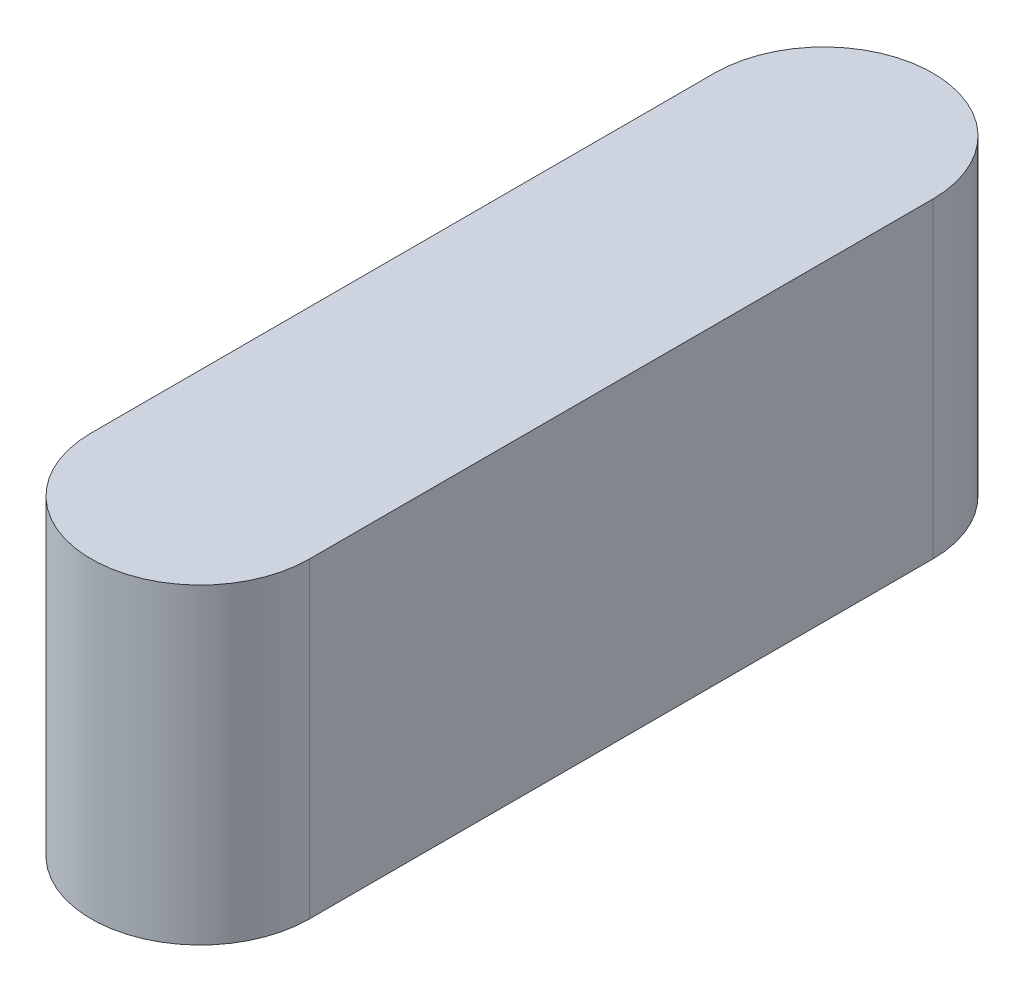
ISO-10303-21;
HEADER;
FILE_DESCRIPTION(('STEP AP214'),'2;1');
FILE_NAME('part.step','',(''),(''),'','','');
FILE_SCHEMA(('AUTOMOTIVE_DESIGN { 1 0 10303 214 1 1 1 1 }'));
ENDSEC;
DATA;
#1=APPLICATION_CONTEXT('core data for automotive mechanical design processes');
#2=APPLICATION_PROTOCOL_DEFINITION('international standard','automotive_design',2000,#1);
#3=PRODUCT_CONTEXT('',#1,'mechanical');
#4=PRODUCT('Part','Part','',(#3));
#5=PRODUCT_RELATED_PRODUCT_CATEGORY('part','',(#4));
#6=PRODUCT_DEFINITION_FORMATION('','',#4);
#7=PRODUCT_DEFINITION_CONTEXT('part definition',#1,'design');
#8=PRODUCT_DEFINITION('design','',#6,#7);
#9=PRODUCT_DEFINITION_SHAPE('','',#8);
#10=(LENGTH_UNIT() NAMED_UNIT(*) SI_UNIT(.MILLI.,.METRE.));
#11=(NAMED_UNIT(*) PLANE_ANGLE_UNIT() SI_UNIT($,.RADIAN.));
#12=(NAMED_UNIT(*) SI_UNIT($,.STERADIAN.) SOLID_ANGLE_UNIT());
#13=UNCERTAINTY_MEASURE_WITH_UNIT(LENGTH_MEASURE(1.E-05),#10,'distance_accuracy_value','');
#14=(GEOMETRIC_REPRESENTATION_CONTEXT(3) GLOBAL_UNCERTAINTY_ASSIGNED_CONTEXT((#13)) GLOBAL_UNIT_ASSIGNED_CONTEXT((#10,
#11,#12)) REPRESENTATION_CONTEXT('',''));
#15=CARTESIAN_POINT('',(0.,0.,0.));
#16=DIRECTION('',(0.,0.,1.));
#17=DIRECTION('',(1.,0.,0.));
#18=AXIS2_PLACEMENT_3D('',#15,#16,#17);
#19=CARTESIAN_POINT('',(0.,5.,8.71399407121683));
#20=DIRECTION('',(0.,-1.,0.));
#21=DIRECTION('',(0.,0.,-1.));
#22=AXIS2_PLACEMENT_3D('',#19,#20,#21);
#23=CYLINDRICAL_SURFACE('',#22,1.75);
#24=CARTESIAN_POINT('',(0.,0.,8.71399407121683));
#25=DIRECTION('',(0.,1.,0.));
#26=DIRECTION('',(0.,0.,1.));
#27=AXIS2_PLACEMENT_3D('',#24,#25,#26);
#28=CIRCLE('',#27,1.75);
#29=CARTESIAN_POINT('',(1.75,0.,8.71399407121684));
#30=VERTEX_POINT('',#29);
#31=CARTESIAN_POINT('',(-1.75,0.,8.71399407121683));
#32=VERTEX_POINT('',#31);
#33=EDGE_CURVE('E98',#30,#32,#28,.T.);
#34=ORIENTED_EDGE('',*,*,#33,.T.);
#35=DIRECTION('',(0.,-1.,0.));
#36=VECTOR('',#35,1.);
#37=CARTESIAN_POINT('',(-1.75,5.,8.71399407121683));
#38=LINE('',#37,#36);
#39=CARTESIAN_POINT('',(-1.75,5.,8.71399407121683));
#40=VERTEX_POINT('',#39);
#41=EDGE_CURVE('E11',#40,#32,#38,.T.);
#42=ORIENTED_EDGE('',*,*,#41,.F.);
#43=CARTESIAN_POINT('',(0.,5.,8.71399407121683));
#44=DIRECTION('',(0.,1.,0.));
#45=DIRECTION('',(0.,0.,1.));
#46=AXIS2_PLACEMENT_3D('',#43,#44,#45);
#47=CIRCLE('',#46,1.75);
#48=CARTESIAN_POINT('',(1.75,5.,8.71399407121684));
#49=VERTEX_POINT('',#48);
#50=EDGE_CURVE('E86',#49,#40,#47,.T.);
#51=ORIENTED_EDGE('',*,*,#50,.F.);
#52=DIRECTION('',(0.,-1.,0.));
#53=VECTOR('',#52,1.);
#54=CARTESIAN_POINT('',(1.75,5.,8.71399407121684));
#55=LINE('',#54,#53);
#56=EDGE_CURVE('E94',#49,#30,#55,.T.);
#57=ORIENTED_EDGE('',*,*,#56,.T.);
#58=EDGE_LOOP('',(#34,#42,#51,#57));
#59=FACE_BOUND('',#58,.T.);
#60=ADVANCED_FACE('F35',(#59),#23,.T.);
#61=CARTESIAN_POINT('',(-1.75,5.,8.71399407121683));
#62=DIRECTION('',(1.,0.,0.));
#63=DIRECTION('',(0.,0.,-1.));
#64=AXIS2_PLACEMENT_3D('',#61,#62,#63);
#65=PLANE('',#64);
#66=DIRECTION('',(0.,0.,1.));
#67=VECTOR('',#66,1.);
#68=CARTESIAN_POINT('',(-1.75,0.,8.71399407121683));
#69=LINE('',#68,#67);
#70=CARTESIAN_POINT('',(-1.75000000000001,0.,18.7139940712168));
#71=VERTEX_POINT('',#70);
#72=EDGE_CURVE('E90',#32,#71,#69,.T.);
#73=ORIENTED_EDGE('',*,*,#72,.T.);
#74=DIRECTION('',(0.,-1.,0.));
#75=VECTOR('',#74,1.);
#76=CARTESIAN_POINT('',(-1.75000000000001,5.,18.7139940712168));
#77=LINE('',#76,#75);
#78=CARTESIAN_POINT('',(-1.75000000000001,5.,18.7139940712168));
#79=VERTEX_POINT('',#78);
#80=EDGE_CURVE('E43',#79,#71,#77,.T.);
#81=ORIENTED_EDGE('',*,*,#80,.F.);
#82=DIRECTION('',(0.,0.,1.));
#83=VECTOR('',#82,1.);
#84=CARTESIAN_POINT('',(-1.75,5.,8.71399407121683));
#85=LINE('',#84,#83);
#86=EDGE_CURVE('E81',#40,#79,#85,.T.);
#87=ORIENTED_EDGE('',*,*,#86,.F.);
#88=ORIENTED_EDGE('',*,*,#41,.T.);
#89=EDGE_LOOP('',(#73,#81,#87,#88));
#90=FACE_BOUND('',#89,.T.);
#91=ADVANCED_FACE('F89',(#90),#65,.F.);
#92=CARTESIAN_POINT('',(0.,5.,18.7139940712168));
#93=DIRECTION('',(0.,-1.,0.));
#94=DIRECTION('',(0.,0.,-1.));
#95=AXIS2_PLACEMENT_3D('',#92,#93,#94);
#96=CYLINDRICAL_SURFACE('',#95,1.75000000000001);
#97=CARTESIAN_POINT('',(0.,0.,18.7139940712168));
#98=DIRECTION('',(0.,1.,0.));
#99=DIRECTION('',(0.,0.,1.));
#100=AXIS2_PLACEMENT_3D('',#97,#98,#99);
#101=CIRCLE('',#100,1.75000000000001);
#102=CARTESIAN_POINT('',(1.75000000000001,0.,18.7139940712168));
#103=VERTEX_POINT('',#102);
#104=EDGE_CURVE('E68',#71,#103,#101,.T.);
#105=ORIENTED_EDGE('',*,*,#104,.T.);
#106=DIRECTION('',(0.,-1.,0.));
#107=VECTOR('',#106,1.);
#108=CARTESIAN_POINT('',(1.75000000000001,5.,18.7139940712168));
#109=LINE('',#108,#107);
#110=CARTESIAN_POINT('',(1.75000000000001,5.,18.7139940712168));
#111=VERTEX_POINT('',#110);
#112=EDGE_CURVE('E91',#111,#103,#109,.T.);
#113=ORIENTED_EDGE('',*,*,#112,.F.);
#114=CARTESIAN_POINT('',(0.,5.,18.7139940712168));
#115=DIRECTION('',(0.,1.,0.));
#116=DIRECTION('',(0.,0.,1.));
#117=AXIS2_PLACEMENT_3D('',#114,#115,#116);
#118=CIRCLE('',#117,1.75000000000001);
#119=EDGE_CURVE('E84',#79,#111,#118,.T.);
#120=ORIENTED_EDGE('',*,*,#119,.F.);
#121=ORIENTED_EDGE('',*,*,#80,.T.);
#122=EDGE_LOOP('',(#105,#113,#120,#121));
#123=FACE_BOUND('',#122,.T.);
#124=ADVANCED_FACE('F92',(#123),#96,.T.);
#125=CARTESIAN_POINT('',(1.75,5.,8.71399407121684));
#126=DIRECTION('',(-1.,0.,0.));
#127=DIRECTION('',(0.,0.,1.));
#128=AXIS2_PLACEMENT_3D('',#125,#126,#127);
#129=PLANE('',#128);
#130=DIRECTION('',(0.,0.,-1.));
#131=VECTOR('',#130,1.);
#132=CARTESIAN_POINT('',(1.75,0.,8.71399407121684));
#133=LINE('',#132,#131);
#134=EDGE_CURVE('E74',#103,#30,#133,.T.);
#135=ORIENTED_EDGE('',*,*,#134,.T.);
#136=ORIENTED_EDGE('',*,*,#56,.F.);
#137=DIRECTION('',(0.,0.,-1.));
#138=VECTOR('',#137,1.);
#139=CARTESIAN_POINT('',(1.75,5.,8.71399407121684));
#140=LINE('',#139,#138);
#141=EDGE_CURVE('E51',#111,#49,#140,.T.);
#142=ORIENTED_EDGE('',*,*,#141,.F.);
#143=ORIENTED_EDGE('',*,*,#112,.T.);
#144=EDGE_LOOP('',(#135,#136,#142,#143));
#145=FACE_BOUND('',#144,.T.);
#146=ADVANCED_FACE('F105',(#145),#129,.F.);
#147=CARTESIAN_POINT('',(0.,5.,8.71399407121683));
#148=DIRECTION('',(0.,1.,0.));
#149=DIRECTION('',(0.,0.,1.));
#150=AXIS2_PLACEMENT_3D('',#147,#148,#149);
#151=PLANE('',#150);
#152=ORIENTED_EDGE('',*,*,#50,.T.);
#153=ORIENTED_EDGE('',*,*,#86,.T.);
#154=ORIENTED_EDGE('',*,*,#119,.T.);
#155=ORIENTED_EDGE('',*,*,#141,.T.);
#156=EDGE_LOOP('',(#152,#153,#154,#155));
#157=FACE_BOUND('',#156,.T.);
#158=ADVANCED_FACE('F82',(#157),#151,.T.);
#159=CARTESIAN_POINT('',(0.,0.,8.71399407121683));
#160=DIRECTION('',(0.,1.,0.));
#161=DIRECTION('',(0.,0.,1.));
#162=AXIS2_PLACEMENT_3D('',#159,#160,#161);
#163=PLANE('',#162);
#164=ORIENTED_EDGE('',*,*,#33,.F.);
#165=ORIENTED_EDGE('',*,*,#134,.F.);
#166=ORIENTED_EDGE('',*,*,#104,.F.);
#167=ORIENTED_EDGE('',*,*,#72,.F.);
#168=EDGE_LOOP('',(#164,#165,#166,#167));
#169=FACE_BOUND('',#168,.T.);
#170=ADVANCED_FACE('F108',(#169),#163,.F.);
#171=CLOSED_SHELL('',(#60,#91,#124,#146,#158,#170));
#172=MANIFOLD_SOLID_BREP('B2',#171);
#173=ADVANCED_BREP_SHAPE_REPRESENTATION('',(#18,#172),#14);
#174=SHAPE_DEFINITION_REPRESENTATION(#9,#173);
ENDSEC;
END-ISO-10303-21;
